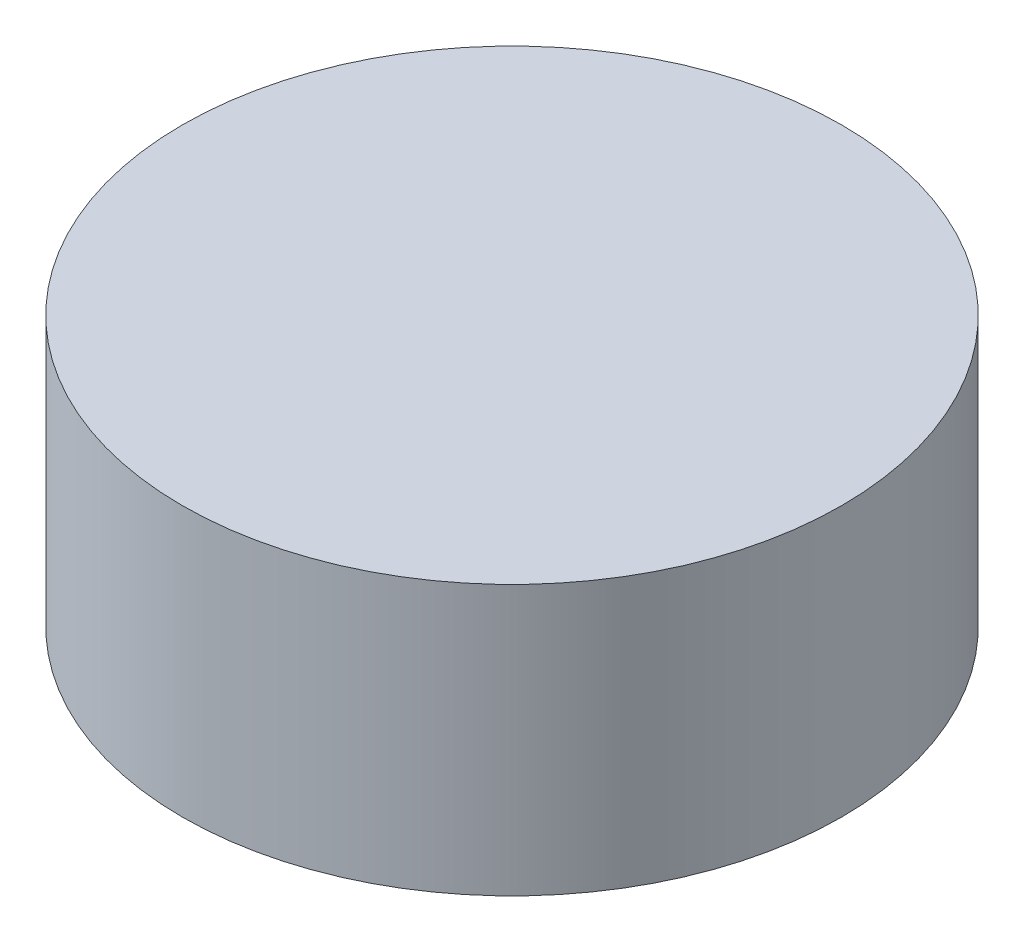
ISO-10303-21;
HEADER;
FILE_DESCRIPTION(('STEP AP214'),'2;1');
FILE_NAME('part.step','',(''),(''),'','','');
FILE_SCHEMA(('AUTOMOTIVE_DESIGN { 1 0 10303 214 1 1 1 1 }'));
ENDSEC;
DATA;
#1=APPLICATION_CONTEXT('core data for automotive mechanical design processes');
#2=APPLICATION_PROTOCOL_DEFINITION('international standard','automotive_design',2000,#1);
#3=PRODUCT_CONTEXT('',#1,'mechanical');
#4=PRODUCT('Part','Part','',(#3));
#5=PRODUCT_RELATED_PRODUCT_CATEGORY('part','',(#4));
#6=PRODUCT_DEFINITION_FORMATION('','',#4);
#7=PRODUCT_DEFINITION_CONTEXT('part definition',#1,'design');
#8=PRODUCT_DEFINITION('design','',#6,#7);
#9=PRODUCT_DEFINITION_SHAPE('','',#8);
#10=(LENGTH_UNIT() NAMED_UNIT(*) SI_UNIT(.MILLI.,.METRE.));
#11=(NAMED_UNIT(*) PLANE_ANGLE_UNIT() SI_UNIT($,.RADIAN.));
#12=(NAMED_UNIT(*) SI_UNIT($,.STERADIAN.) SOLID_ANGLE_UNIT());
#13=UNCERTAINTY_MEASURE_WITH_UNIT(LENGTH_MEASURE(1.E-05),#10,'distance_accuracy_value','');
#14=(GEOMETRIC_REPRESENTATION_CONTEXT(3) GLOBAL_UNCERTAINTY_ASSIGNED_CONTEXT((#13)) GLOBAL_UNIT_ASSIGNED_CONTEXT((#10,
#11,#12)) REPRESENTATION_CONTEXT('',''));
#15=CARTESIAN_POINT('',(0.,0.,0.));
#16=DIRECTION('',(0.,0.,1.));
#17=DIRECTION('',(1.,0.,0.));
#18=AXIS2_PLACEMENT_3D('',#15,#16,#17);
#19=CARTESIAN_POINT('',(0.,4.5,0.));
#20=DIRECTION('',(0.,-1.,0.));
#21=DIRECTION('',(0.,0.,-1.));
#22=AXIS2_PLACEMENT_3D('',#19,#20,#21);
#23=PLANE('',#22);
#24=CARTESIAN_POINT('',(0.,4.5,0.));
#25=DIRECTION('',(0.,1.,0.));
#26=DIRECTION('',(0.,0.,1.));
#27=AXIS2_PLACEMENT_3D('',#24,#25,#26);
#28=CIRCLE('',#27,5.5);
#29=CARTESIAN_POINT('',(0.,4.5,5.5));
#30=VERTEX_POINT('',#29);
#31=EDGE_CURVE('E10',#30,#30,#28,.T.);
#32=ORIENTED_EDGE('',*,*,#31,.T.);
#33=EDGE_LOOP('',(#32));
#34=FACE_BOUND('',#33,.T.);
#35=ADVANCED_FACE('F37',(#34),#23,.F.);
#36=CARTESIAN_POINT('',(0.,0.,0.));
#37=DIRECTION('',(0.,1.,0.));
#38=DIRECTION('',(0.,0.,1.));
#39=AXIS2_PLACEMENT_3D('',#36,#37,#38);
#40=CYLINDRICAL_SURFACE('',#39,5.5);
#41=ORIENTED_EDGE('',*,*,#31,.F.);
#42=EDGE_LOOP('',(#41));
#43=FACE_BOUND('',#42,.T.);
#44=CARTESIAN_POINT('',(0.,0.,0.));
#45=DIRECTION('',(0.,1.,0.));
#46=DIRECTION('',(0.,0.,1.));
#47=AXIS2_PLACEMENT_3D('',#44,#45,#46);
#48=CIRCLE('',#47,5.5);
#49=CARTESIAN_POINT('',(0.,0.,5.5));
#50=VERTEX_POINT('',#49);
#51=EDGE_CURVE('E43',#50,#50,#48,.T.);
#52=ORIENTED_EDGE('',*,*,#51,.T.);
#53=EDGE_LOOP('',(#52));
#54=FACE_BOUND('',#53,.T.);
#55=ADVANCED_FACE('F49',(#43,#54),#40,.T.);
#56=CARTESIAN_POINT('',(5.5,0.,0.));
#57=DIRECTION('',(0.,1.,0.));
#58=DIRECTION('',(0.,0.,1.));
#59=AXIS2_PLACEMENT_3D('',#56,#57,#58);
#60=PLANE('',#59);
#61=ORIENTED_EDGE('',*,*,#51,.F.);
#62=EDGE_LOOP('',(#61));
#63=FACE_BOUND('',#62,.T.);
#64=ADVANCED_FACE('F51',(#63),#60,.F.);
#65=CLOSED_SHELL('',(#35,#55,#64));
#66=MANIFOLD_SOLID_BREP('B2',#65);
#67=ADVANCED_BREP_SHAPE_REPRESENTATION('',(#18,#66),#14);
#68=SHAPE_DEFINITION_REPRESENTATION(#9,#67);
ENDSEC;
END-ISO-10303-21;
